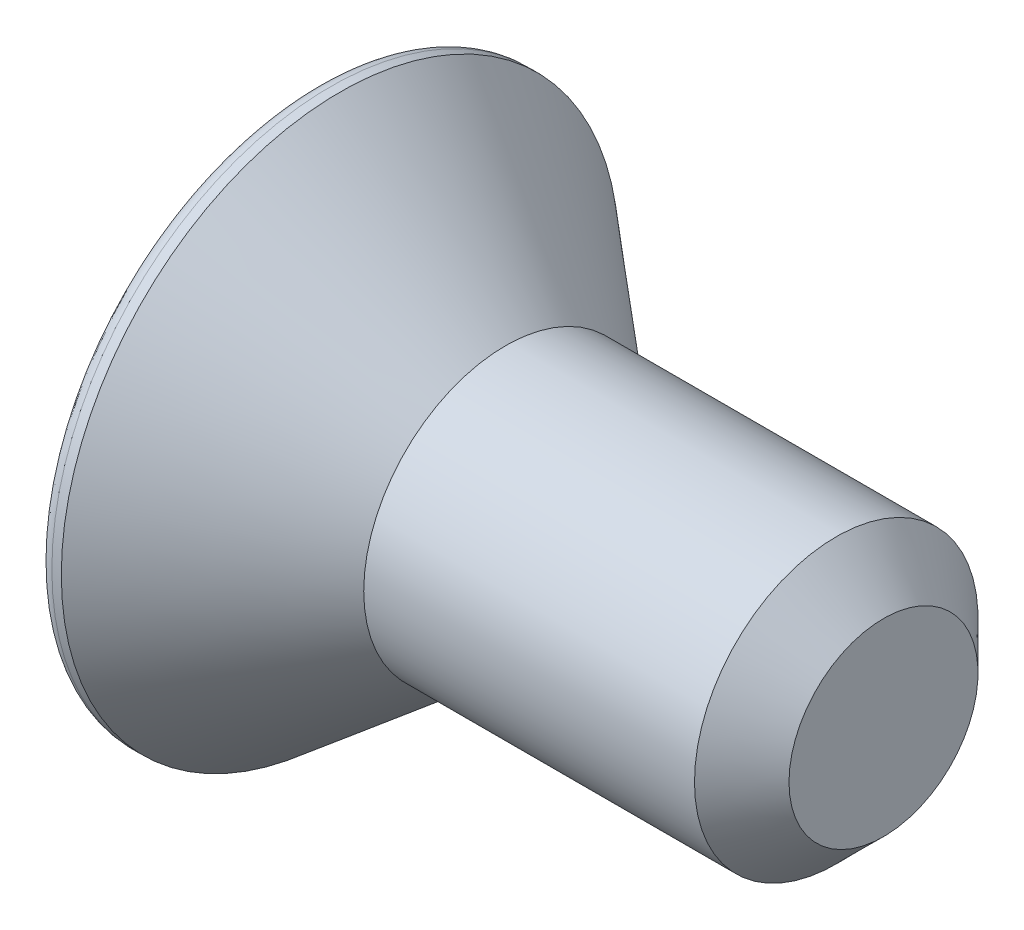
ISO-10303-21;
HEADER;
FILE_DESCRIPTION(('STEP AP214'),'2;1');
FILE_NAME('part.step','',(''),(''),'','','');
FILE_SCHEMA(('AUTOMOTIVE_DESIGN { 1 0 10303 214 1 1 1 1 }'));
ENDSEC;
DATA;
#1=APPLICATION_CONTEXT('core data for automotive mechanical design processes');
#2=APPLICATION_PROTOCOL_DEFINITION('international standard','automotive_design',2000,#1);
#3=PRODUCT_CONTEXT('',#1,'mechanical');
#4=PRODUCT('Part','Part','',(#3));
#5=PRODUCT_RELATED_PRODUCT_CATEGORY('part','',(#4));
#6=PRODUCT_DEFINITION_FORMATION('','',#4);
#7=PRODUCT_DEFINITION_CONTEXT('part definition',#1,'design');
#8=PRODUCT_DEFINITION('design','',#6,#7);
#9=PRODUCT_DEFINITION_SHAPE('','',#8);
#10=(LENGTH_UNIT() NAMED_UNIT(*) SI_UNIT(.MILLI.,.METRE.));
#11=(NAMED_UNIT(*) PLANE_ANGLE_UNIT() SI_UNIT($,.RADIAN.));
#12=(NAMED_UNIT(*) SI_UNIT($,.STERADIAN.) SOLID_ANGLE_UNIT());
#13=UNCERTAINTY_MEASURE_WITH_UNIT(LENGTH_MEASURE(1.E-05),#10,'distance_accuracy_value','');
#14=(GEOMETRIC_REPRESENTATION_CONTEXT(3) GLOBAL_UNCERTAINTY_ASSIGNED_CONTEXT((#13)) GLOBAL_UNIT_ASSIGNED_CONTEXT((#10,
#11,#12)) REPRESENTATION_CONTEXT('',''));
#15=CARTESIAN_POINT('',(0.,0.,0.));
#16=DIRECTION('',(0.,0.,1.));
#17=DIRECTION('',(1.,0.,0.));
#18=AXIS2_PLACEMENT_3D('',#15,#16,#17);
#19=CARTESIAN_POINT('',(0.,0.,0.));
#20=DIRECTION('',(1.,0.,0.));
#21=DIRECTION('',(0.,0.,-1.));
#22=AXIS2_PLACEMENT_3D('',#19,#20,#21);
#23=PLANE('',#22);
#24=CARTESIAN_POINT('',(0.,0.,0.));
#25=DIRECTION('',(1.,0.,0.));
#26=DIRECTION('',(0.,0.,-1.));
#27=AXIS2_PLACEMENT_3D('',#24,#25,#26);
#28=CIRCLE('',#27,5.6);
#29=CARTESIAN_POINT('',(0.,0.,-5.6));
#30=VERTEX_POINT('',#29);
#31=EDGE_CURVE('E153',#30,#30,#28,.F.);
#32=ORIENTED_EDGE('',*,*,#31,.T.);
#33=EDGE_LOOP('',(#32));
#34=FACE_BOUND('',#33,.T.);
#35=DIRECTION('',(0.,0.,-1.));
#36=VECTOR('',#35,1.);
#37=CARTESIAN_POINT('',(0.,2.,1.15470053837925));
#38=LINE('',#37,#36);
#39=CARTESIAN_POINT('',(0.,2.,1.15470053837925));
#40=VERTEX_POINT('',#39);
#41=CARTESIAN_POINT('',(0.,2.,-1.15470053837925));
#42=VERTEX_POINT('',#41);
#43=EDGE_CURVE('E129',#40,#42,#38,.T.);
#44=ORIENTED_EDGE('',*,*,#43,.F.);
#45=DIRECTION('',(0.,0.866025403784438,-0.5));
#46=VECTOR('',#45,1.);
#47=CARTESIAN_POINT('',(0.,0.,2.3094010767585));
#48=LINE('',#47,#46);
#49=CARTESIAN_POINT('',(0.,0.,2.3094010767585));
#50=VERTEX_POINT('',#49);
#51=EDGE_CURVE('E55',#50,#40,#48,.T.);
#52=ORIENTED_EDGE('',*,*,#51,.F.);
#53=DIRECTION('',(0.,0.866025403784438,0.5));
#54=VECTOR('',#53,1.);
#55=CARTESIAN_POINT('',(0.,-2.,1.15470053837925));
#56=LINE('',#55,#54);
#57=CARTESIAN_POINT('',(0.,-2.,1.15470053837925));
#58=VERTEX_POINT('',#57);
#59=EDGE_CURVE('E138',#58,#50,#56,.T.);
#60=ORIENTED_EDGE('',*,*,#59,.F.);
#61=DIRECTION('',(0.,0.,1.));
#62=VECTOR('',#61,1.);
#63=CARTESIAN_POINT('',(0.,-2.,-1.15470053837925));
#64=LINE('',#63,#62);
#65=CARTESIAN_POINT('',(0.,-2.,-1.15470053837925));
#66=VERTEX_POINT('',#65);
#67=EDGE_CURVE('E136',#66,#58,#64,.T.);
#68=ORIENTED_EDGE('',*,*,#67,.F.);
#69=DIRECTION('',(0.,-0.866025403784439,0.5));
#70=VECTOR('',#69,1.);
#71=CARTESIAN_POINT('',(0.,0.,-2.3094010767585));
#72=LINE('',#71,#70);
#73=CARTESIAN_POINT('',(0.,0.,-2.3094010767585));
#74=VERTEX_POINT('',#73);
#75=EDGE_CURVE('E103',#74,#66,#72,.T.);
#76=ORIENTED_EDGE('',*,*,#75,.F.);
#77=DIRECTION('',(0.,-0.866025403784439,-0.5));
#78=VECTOR('',#77,1.);
#79=CARTESIAN_POINT('',(0.,2.,-1.15470053837925));
#80=LINE('',#79,#78);
#81=EDGE_CURVE('E132',#42,#74,#80,.T.);
#82=ORIENTED_EDGE('',*,*,#81,.F.);
#83=EDGE_LOOP('',(#44,#52,#60,#68,#76,#82));
#84=FACE_BOUND('',#83,.T.);
#85=ADVANCED_FACE('F39',(#34,#84),#23,.F.);
#86=CARTESIAN_POINT('',(0.,0.,0.));
#87=DIRECTION('',(-1.,0.,0.));
#88=DIRECTION('',(0.,0.,1.));
#89=AXIS2_PLACEMENT_3D('',#86,#87,#88);
#90=CYLINDRICAL_SURFACE('',#89,5.9);
#91=CARTESIAN_POINT('',(0.3,0.,0.));
#92=DIRECTION('',(1.,0.,0.));
#93=DIRECTION('',(0.,0.,-1.));
#94=AXIS2_PLACEMENT_3D('',#91,#92,#93);
#95=CIRCLE('',#94,5.9);
#96=CARTESIAN_POINT('',(0.3,0.,-5.9));
#97=VERTEX_POINT('',#96);
#98=EDGE_CURVE('E156',#97,#97,#95,.T.);
#99=ORIENTED_EDGE('',*,*,#98,.T.);
#100=EDGE_LOOP('',(#99));
#101=FACE_BOUND('',#100,.T.);
#102=CARTESIAN_POINT('',(0.5,0.,0.));
#103=DIRECTION('',(-1.,0.,0.));
#104=DIRECTION('',(0.,0.,1.));
#105=AXIS2_PLACEMENT_3D('',#102,#103,#104);
#106=CIRCLE('',#105,5.9);
#107=CARTESIAN_POINT('',(0.5,0.,5.9));
#108=VERTEX_POINT('',#107);
#109=EDGE_CURVE('E150',#108,#108,#106,.T.);
#110=ORIENTED_EDGE('',*,*,#109,.T.);
#111=EDGE_LOOP('',(#110));
#112=FACE_BOUND('',#111,.T.);
#113=ADVANCED_FACE('F173',(#101,#112),#90,.T.);
#114=CARTESIAN_POINT('',(4.,0.,0.));
#115=DIRECTION('',(-1.,0.,0.));
#116=DIRECTION('',(0.,0.,1.));
#117=AXIS2_PLACEMENT_3D('',#114,#115,#116);
#118=CONICAL_SURFACE('',#117,3.,0.691921382238859);
#119=ORIENTED_EDGE('',*,*,#109,.F.);
#120=EDGE_LOOP('',(#119));
#121=FACE_BOUND('',#120,.T.);
#122=CARTESIAN_POINT('',(4.,0.,0.));
#123=DIRECTION('',(-1.,0.,0.));
#124=DIRECTION('',(0.,0.,1.));
#125=AXIS2_PLACEMENT_3D('',#122,#123,#124);
#126=CIRCLE('',#125,3.);
#127=CARTESIAN_POINT('',(4.,0.,3.));
#128=VERTEX_POINT('',#127);
#129=EDGE_CURVE('E142',#128,#128,#126,.T.);
#130=ORIENTED_EDGE('',*,*,#129,.T.);
#131=EDGE_LOOP('',(#130));
#132=FACE_BOUND('',#131,.T.);
#133=ADVANCED_FACE('F179',(#121,#132),#118,.T.);
#134=CARTESIAN_POINT('',(0.,0.,0.));
#135=DIRECTION('',(-1.,0.,0.));
#136=DIRECTION('',(0.,0.,1.));
#137=AXIS2_PLACEMENT_3D('',#134,#135,#136);
#138=CYLINDRICAL_SURFACE('',#137,3.);
#139=CARTESIAN_POINT('',(11.,0.,0.));
#140=DIRECTION('',(-1.,0.,0.));
#141=DIRECTION('',(0.,0.,1.));
#142=AXIS2_PLACEMENT_3D('',#139,#140,#141);
#143=CIRCLE('',#142,3.);
#144=CARTESIAN_POINT('',(11.,0.,3.));
#145=VERTEX_POINT('',#144);
#146=EDGE_CURVE('E48',#145,#145,#143,.T.);
#147=ORIENTED_EDGE('',*,*,#146,.T.);
#148=EDGE_LOOP('',(#147));
#149=FACE_BOUND('',#148,.T.);
#150=ORIENTED_EDGE('',*,*,#129,.F.);
#151=EDGE_LOOP('',(#150));
#152=FACE_BOUND('',#151,.T.);
#153=ADVANCED_FACE('F161',(#149,#152),#138,.T.);
#154=CARTESIAN_POINT('',(12.,3.,0.));
#155=DIRECTION('',(-1.,0.,0.));
#156=DIRECTION('',(0.,0.,1.));
#157=AXIS2_PLACEMENT_3D('',#154,#155,#156);
#158=PLANE('',#157);
#159=CARTESIAN_POINT('',(12.,0.,0.));
#160=DIRECTION('',(-1.,0.,0.));
#161=DIRECTION('',(0.,0.,1.));
#162=AXIS2_PLACEMENT_3D('',#159,#160,#161);
#163=CIRCLE('',#162,1.99999999999998);
#164=CARTESIAN_POINT('',(12.,0.,1.99999999999998));
#165=VERTEX_POINT('',#164);
#166=EDGE_CURVE('E11',#165,#165,#163,.F.);
#167=ORIENTED_EDGE('',*,*,#166,.T.);
#168=EDGE_LOOP('',(#167));
#169=FACE_BOUND('',#168,.T.);
#170=ADVANCED_FACE('F189',(#169),#158,.F.);
#171=CARTESIAN_POINT('',(3.,0.,2.3094010767585));
#172=DIRECTION('',(0.,0.5,0.866025403784439));
#173=DIRECTION('',(0.,-0.866025403784439,0.5));
#174=AXIS2_PLACEMENT_3D('',#171,#172,#173);
#175=PLANE('',#174);
#176=ORIENTED_EDGE('',*,*,#51,.T.);
#177=DIRECTION('',(-1.,0.,0.));
#178=VECTOR('',#177,1.);
#179=CARTESIAN_POINT('',(3.,2.,1.15470053837925));
#180=LINE('',#179,#178);
#181=CARTESIAN_POINT('',(3.,2.,1.15470053837925));
#182=VERTEX_POINT('',#181);
#183=EDGE_CURVE('E85',#182,#40,#180,.T.);
#184=ORIENTED_EDGE('',*,*,#183,.F.);
#185=DIRECTION('',(0.,0.866025403784438,-0.5));
#186=VECTOR('',#185,1.);
#187=CARTESIAN_POINT('',(3.,0.,2.3094010767585));
#188=LINE('',#187,#186);
#189=CARTESIAN_POINT('',(3.,0.,2.3094010767585));
#190=VERTEX_POINT('',#189);
#191=EDGE_CURVE('E140',#190,#182,#188,.T.);
#192=ORIENTED_EDGE('',*,*,#191,.F.);
#193=DIRECTION('',(-1.,0.,0.));
#194=VECTOR('',#193,1.);
#195=CARTESIAN_POINT('',(3.,0.,2.3094010767585));
#196=LINE('',#195,#194);
#197=EDGE_CURVE('E63',#190,#50,#196,.T.);
#198=ORIENTED_EDGE('',*,*,#197,.T.);
#199=EDGE_LOOP('',(#176,#184,#192,#198));
#200=FACE_BOUND('',#199,.T.);
#201=ADVANCED_FACE('F192',(#200),#175,.F.);
#202=CARTESIAN_POINT('',(3.,-2.,1.15470053837925));
#203=DIRECTION('',(0.,-0.5,0.866025403784439));
#204=DIRECTION('',(0.,-0.866025403784439,-0.5));
#205=AXIS2_PLACEMENT_3D('',#202,#203,#204);
#206=PLANE('',#205);
#207=ORIENTED_EDGE('',*,*,#59,.T.);
#208=ORIENTED_EDGE('',*,*,#197,.F.);
#209=DIRECTION('',(0.,0.866025403784438,0.5));
#210=VECTOR('',#209,1.);
#211=CARTESIAN_POINT('',(3.,-2.,1.15470053837925));
#212=LINE('',#211,#210);
#213=CARTESIAN_POINT('',(3.,-2.,1.15470053837925));
#214=VERTEX_POINT('',#213);
#215=EDGE_CURVE('E115',#214,#190,#212,.T.);
#216=ORIENTED_EDGE('',*,*,#215,.F.);
#217=DIRECTION('',(-1.,0.,0.));
#218=VECTOR('',#217,1.);
#219=CARTESIAN_POINT('',(3.,-2.,1.15470053837925));
#220=LINE('',#219,#218);
#221=EDGE_CURVE('E107',#214,#58,#220,.T.);
#222=ORIENTED_EDGE('',*,*,#221,.T.);
#223=EDGE_LOOP('',(#207,#208,#216,#222));
#224=FACE_BOUND('',#223,.T.);
#225=ADVANCED_FACE('F196',(#224),#206,.F.);
#226=CARTESIAN_POINT('',(3.,-2.,-1.15470053837925));
#227=DIRECTION('',(0.,-1.,0.));
#228=DIRECTION('',(0.,0.,-1.));
#229=AXIS2_PLACEMENT_3D('',#226,#227,#228);
#230=PLANE('',#229);
#231=ORIENTED_EDGE('',*,*,#67,.T.);
#232=ORIENTED_EDGE('',*,*,#221,.F.);
#233=DIRECTION('',(0.,0.,1.));
#234=VECTOR('',#233,1.);
#235=CARTESIAN_POINT('',(3.,-2.,-1.15470053837925));
#236=LINE('',#235,#234);
#237=CARTESIAN_POINT('',(3.,-2.,-1.15470053837925));
#238=VERTEX_POINT('',#237);
#239=EDGE_CURVE('E111',#238,#214,#236,.T.);
#240=ORIENTED_EDGE('',*,*,#239,.F.);
#241=DIRECTION('',(-1.,0.,0.));
#242=VECTOR('',#241,1.);
#243=CARTESIAN_POINT('',(3.,-2.,-1.15470053837925));
#244=LINE('',#243,#242);
#245=EDGE_CURVE('E96',#238,#66,#244,.T.);
#246=ORIENTED_EDGE('',*,*,#245,.T.);
#247=EDGE_LOOP('',(#231,#232,#240,#246));
#248=FACE_BOUND('',#247,.T.);
#249=ADVANCED_FACE('F112',(#248),#230,.F.);
#250=CARTESIAN_POINT('',(3.,0.,-2.3094010767585));
#251=DIRECTION('',(0.,-0.5,-0.866025403784439));
#252=DIRECTION('',(0.,0.866025403784439,-0.5));
#253=AXIS2_PLACEMENT_3D('',#250,#251,#252);
#254=PLANE('',#253);
#255=ORIENTED_EDGE('',*,*,#75,.T.);
#256=ORIENTED_EDGE('',*,*,#245,.F.);
#257=DIRECTION('',(0.,-0.866025403784439,0.5));
#258=VECTOR('',#257,1.);
#259=CARTESIAN_POINT('',(3.,0.,-2.3094010767585));
#260=LINE('',#259,#258);
#261=CARTESIAN_POINT('',(3.,0.,-2.3094010767585));
#262=VERTEX_POINT('',#261);
#263=EDGE_CURVE('E100',#262,#238,#260,.T.);
#264=ORIENTED_EDGE('',*,*,#263,.F.);
#265=DIRECTION('',(-1.,0.,0.));
#266=VECTOR('',#265,1.);
#267=CARTESIAN_POINT('',(3.,0.,-2.3094010767585));
#268=LINE('',#267,#266);
#269=EDGE_CURVE('E108',#262,#74,#268,.T.);
#270=ORIENTED_EDGE('',*,*,#269,.T.);
#271=EDGE_LOOP('',(#255,#256,#264,#270));
#272=FACE_BOUND('',#271,.T.);
#273=ADVANCED_FACE('F98',(#272),#254,.F.);
#274=CARTESIAN_POINT('',(3.,2.,-1.15470053837925));
#275=DIRECTION('',(0.,0.5,-0.866025403784439));
#276=DIRECTION('',(0.,0.866025403784439,0.5));
#277=AXIS2_PLACEMENT_3D('',#274,#275,#276);
#278=PLANE('',#277);
#279=ORIENTED_EDGE('',*,*,#81,.T.);
#280=ORIENTED_EDGE('',*,*,#269,.F.);
#281=DIRECTION('',(0.,-0.866025403784439,-0.5));
#282=VECTOR('',#281,1.);
#283=CARTESIAN_POINT('',(3.,2.,-1.15470053837925));
#284=LINE('',#283,#282);
#285=CARTESIAN_POINT('',(3.,2.,-1.15470053837925));
#286=VERTEX_POINT('',#285);
#287=EDGE_CURVE('E121',#286,#262,#284,.T.);
#288=ORIENTED_EDGE('',*,*,#287,.F.);
#289=DIRECTION('',(-1.,0.,0.));
#290=VECTOR('',#289,1.);
#291=CARTESIAN_POINT('',(3.,2.,-1.15470053837925));
#292=LINE('',#291,#290);
#293=EDGE_CURVE('E145',#286,#42,#292,.T.);
#294=ORIENTED_EDGE('',*,*,#293,.T.);
#295=EDGE_LOOP('',(#279,#280,#288,#294));
#296=FACE_BOUND('',#295,.T.);
#297=ADVANCED_FACE('F200',(#296),#278,.F.);
#298=CARTESIAN_POINT('',(3.,2.,1.15470053837925));
#299=DIRECTION('',(0.,1.,0.));
#300=DIRECTION('',(0.,0.,1.));
#301=AXIS2_PLACEMENT_3D('',#298,#299,#300);
#302=PLANE('',#301);
#303=ORIENTED_EDGE('',*,*,#43,.T.);
#304=ORIENTED_EDGE('',*,*,#293,.F.);
#305=DIRECTION('',(0.,0.,-1.));
#306=VECTOR('',#305,1.);
#307=CARTESIAN_POINT('',(3.,2.,1.15470053837925));
#308=LINE('',#307,#306);
#309=EDGE_CURVE('E123',#182,#286,#308,.T.);
#310=ORIENTED_EDGE('',*,*,#309,.F.);
#311=ORIENTED_EDGE('',*,*,#183,.T.);
#312=EDGE_LOOP('',(#303,#304,#310,#311));
#313=FACE_BOUND('',#312,.T.);
#314=ADVANCED_FACE('F197',(#313),#302,.F.);
#315=CARTESIAN_POINT('',(3.,0.,0.));
#316=DIRECTION('',(-1.,0.,0.));
#317=DIRECTION('',(0.,0.,1.));
#318=AXIS2_PLACEMENT_3D('',#315,#316,#317);
#319=PLANE('',#318);
#320=ORIENTED_EDGE('',*,*,#191,.T.);
#321=ORIENTED_EDGE('',*,*,#309,.T.);
#322=ORIENTED_EDGE('',*,*,#287,.T.);
#323=ORIENTED_EDGE('',*,*,#263,.T.);
#324=ORIENTED_EDGE('',*,*,#239,.T.);
#325=ORIENTED_EDGE('',*,*,#215,.T.);
#326=EDGE_LOOP('',(#320,#321,#322,#323,#324,#325));
#327=FACE_BOUND('',#326,.T.);
#328=ADVANCED_FACE('F118',(#327),#319,.T.);
#329=CARTESIAN_POINT('',(0.3,0.,0.));
#330=DIRECTION('',(1.,0.,0.));
#331=DIRECTION('',(0.,0.,-1.));
#332=AXIS2_PLACEMENT_3D('',#329,#330,#331);
#333=TOROIDAL_SURFACE('',#332,5.6,0.3);
#334=ORIENTED_EDGE('',*,*,#98,.F.);
#335=EDGE_LOOP('',(#334));
#336=FACE_BOUND('',#335,.T.);
#337=ORIENTED_EDGE('',*,*,#31,.F.);
#338=EDGE_LOOP('',(#337));
#339=FACE_BOUND('',#338,.T.);
#340=ADVANCED_FACE('F165',(#336,#339),#333,.T.);
#341=CARTESIAN_POINT('',(11.,0.,0.));
#342=DIRECTION('',(-1.,0.,0.));
#343=DIRECTION('',(0.,0.,1.));
#344=AXIS2_PLACEMENT_3D('',#341,#342,#343);
#345=CONICAL_SURFACE('',#344,3.,0.785398163397453);
#346=ORIENTED_EDGE('',*,*,#166,.F.);
#347=EDGE_LOOP('',(#346));
#348=FACE_BOUND('',#347,.T.);
#349=ORIENTED_EDGE('',*,*,#146,.F.);
#350=EDGE_LOOP('',(#349));
#351=FACE_BOUND('',#350,.T.);
#352=ADVANCED_FACE('F42',(#348,#351),#345,.T.);
#353=CLOSED_SHELL('',(#85,#113,#133,#153,#170,#201,#225,#249,#273,#297,#314,#328,#340,#352));
#354=MANIFOLD_SOLID_BREP('B2',#353);
#355=ADVANCED_BREP_SHAPE_REPRESENTATION('',(#18,#354),#14);
#356=SHAPE_DEFINITION_REPRESENTATION(#9,#355);
ENDSEC;
END-ISO-10303-21;
